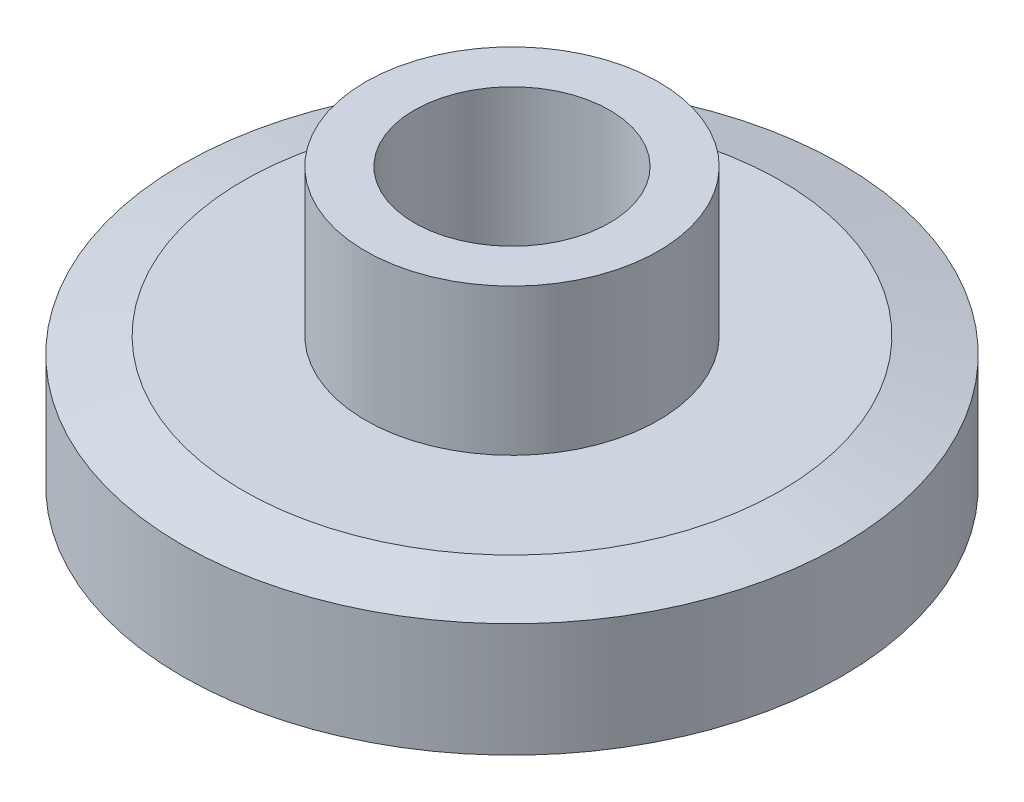
ISO-10303-21;
HEADER;
FILE_DESCRIPTION(('STEP AP214'),'2;1');
FILE_NAME('part.step','',(''),(''),'','','');
FILE_SCHEMA(('AUTOMOTIVE_DESIGN { 1 0 10303 214 1 1 1 1 }'));
ENDSEC;
DATA;
#1=APPLICATION_CONTEXT('core data for automotive mechanical design processes');
#2=APPLICATION_PROTOCOL_DEFINITION('international standard','automotive_design',2000,#1);
#3=PRODUCT_CONTEXT('',#1,'mechanical');
#4=PRODUCT('Part','Part','',(#3));
#5=PRODUCT_RELATED_PRODUCT_CATEGORY('part','',(#4));
#6=PRODUCT_DEFINITION_FORMATION('','',#4);
#7=PRODUCT_DEFINITION_CONTEXT('part definition',#1,'design');
#8=PRODUCT_DEFINITION('design','',#6,#7);
#9=PRODUCT_DEFINITION_SHAPE('','',#8);
#10=(LENGTH_UNIT() NAMED_UNIT(*) SI_UNIT(.MILLI.,.METRE.));
#11=(NAMED_UNIT(*) PLANE_ANGLE_UNIT() SI_UNIT($,.RADIAN.));
#12=(NAMED_UNIT(*) SI_UNIT($,.STERADIAN.) SOLID_ANGLE_UNIT());
#13=UNCERTAINTY_MEASURE_WITH_UNIT(LENGTH_MEASURE(1.E-05),#10,'distance_accuracy_value','');
#14=(GEOMETRIC_REPRESENTATION_CONTEXT(3) GLOBAL_UNCERTAINTY_ASSIGNED_CONTEXT((#13)) GLOBAL_UNIT_ASSIGNED_CONTEXT((#10,
#11,#12)) REPRESENTATION_CONTEXT('',''));
#15=CARTESIAN_POINT('',(0.,0.,0.));
#16=DIRECTION('',(0.,0.,1.));
#17=DIRECTION('',(1.,0.,0.));
#18=AXIS2_PLACEMENT_3D('',#15,#16,#17);
#19=CARTESIAN_POINT('',(0.,0.,0.));
#20=DIRECTION('',(0.,1.,0.));
#21=DIRECTION('',(-1.,0.,0.));
#22=AXIS2_PLACEMENT_3D('',#19,#20,#21);
#23=PLANE('',#22);
#24=CARTESIAN_POINT('',(0.,0.,0.));
#25=DIRECTION('',(0.,1.,0.));
#26=DIRECTION('',(-1.,0.,0.));
#27=AXIS2_PLACEMENT_3D('',#24,#25,#26);
#28=CIRCLE('',#27,2.);
#29=CARTESIAN_POINT('',(-2.,0.,0.));
#30=VERTEX_POINT('',#29);
#31=EDGE_CURVE('E72',#30,#30,#28,.T.);
#32=ORIENTED_EDGE('',*,*,#31,.T.);
#33=EDGE_LOOP('',(#32));
#34=FACE_BOUND('',#33,.T.);
#35=CARTESIAN_POINT('',(0.,0.,0.));
#36=DIRECTION('',(0.,1.,0.));
#37=DIRECTION('',(-1.,0.,0.));
#38=AXIS2_PLACEMENT_3D('',#35,#36,#37);
#39=CIRCLE('',#38,5.49999999999999);
#40=CARTESIAN_POINT('',(-5.49999999999999,0.,0.));
#41=VERTEX_POINT('',#40);
#42=EDGE_CURVE('E10',#41,#41,#39,.F.);
#43=ORIENTED_EDGE('',*,*,#42,.T.);
#44=EDGE_LOOP('',(#43));
#45=FACE_BOUND('',#44,.T.);
#46=ADVANCED_FACE('F39',(#34,#45),#23,.F.);
#47=CARTESIAN_POINT('',(0.,6.,0.));
#48=DIRECTION('',(0.,1.,0.));
#49=DIRECTION('',(-1.,0.,0.));
#50=AXIS2_PLACEMENT_3D('',#47,#48,#49);
#51=CYLINDRICAL_SURFACE('',#50,6.75);
#52=CARTESIAN_POINT('',(0.,0.3349364905389,0.));
#53=DIRECTION('',(0.,1.,0.));
#54=DIRECTION('',(-1.,0.,0.));
#55=AXIS2_PLACEMENT_3D('',#52,#53,#54);
#56=CIRCLE('',#55,6.75);
#57=CARTESIAN_POINT('',(-6.75,0.334936490538898,0.));
#58=VERTEX_POINT('',#57);
#59=EDGE_CURVE('E48',#58,#58,#56,.T.);
#60=ORIENTED_EDGE('',*,*,#59,.T.);
#61=EDGE_LOOP('',(#60));
#62=FACE_BOUND('',#61,.T.);
#63=CARTESIAN_POINT('',(0.,2.6650635094611,0.));
#64=DIRECTION('',(0.,-1.,0.));
#65=DIRECTION('',(1.,0.,0.));
#66=AXIS2_PLACEMENT_3D('',#63,#64,#65);
#67=CIRCLE('',#66,6.75);
#68=CARTESIAN_POINT('',(6.75,2.6650635094611,0.));
#69=VERTEX_POINT('',#68);
#70=EDGE_CURVE('E53',#69,#69,#67,.T.);
#71=ORIENTED_EDGE('',*,*,#70,.T.);
#72=EDGE_LOOP('',(#71));
#73=FACE_BOUND('',#72,.T.);
#74=ADVANCED_FACE('F103',(#62,#73),#51,.T.);
#75=CARTESIAN_POINT('',(6.75,3.,0.));
#76=DIRECTION('',(0.,-1.,0.));
#77=DIRECTION('',(1.,0.,0.));
#78=AXIS2_PLACEMENT_3D('',#75,#76,#77);
#79=PLANE('',#78);
#80=CARTESIAN_POINT('',(0.,3.,0.));
#81=DIRECTION('',(0.,-1.,0.));
#82=DIRECTION('',(1.,0.,0.));
#83=AXIS2_PLACEMENT_3D('',#80,#81,#82);
#84=CIRCLE('',#83,5.49999999999999);
#85=CARTESIAN_POINT('',(5.49999999999998,3.,0.));
#86=VERTEX_POINT('',#85);
#87=EDGE_CURVE('E58',#86,#86,#84,.F.);
#88=ORIENTED_EDGE('',*,*,#87,.T.);
#89=EDGE_LOOP('',(#88));
#90=FACE_BOUND('',#89,.T.);
#91=CARTESIAN_POINT('',(0.,3.,0.));
#92=DIRECTION('',(0.,1.,0.));
#93=DIRECTION('',(-1.,0.,0.));
#94=AXIS2_PLACEMENT_3D('',#91,#92,#93);
#95=CIRCLE('',#94,3.);
#96=CARTESIAN_POINT('',(-3.,3.,0.));
#97=VERTEX_POINT('',#96);
#98=EDGE_CURVE('E64',#97,#97,#95,.T.);
#99=ORIENTED_EDGE('',*,*,#98,.F.);
#100=EDGE_LOOP('',(#99));
#101=FACE_BOUND('',#100,.T.);
#102=ADVANCED_FACE('F98',(#90,#101),#79,.F.);
#103=CARTESIAN_POINT('',(0.,6.,0.));
#104=DIRECTION('',(0.,1.,0.));
#105=DIRECTION('',(-1.,0.,0.));
#106=AXIS2_PLACEMENT_3D('',#103,#104,#105);
#107=CYLINDRICAL_SURFACE('',#106,3.);
#108=CARTESIAN_POINT('',(0.,6.,0.));
#109=DIRECTION('',(0.,1.,0.));
#110=DIRECTION('',(-1.,0.,0.));
#111=AXIS2_PLACEMENT_3D('',#108,#109,#110);
#112=CIRCLE('',#111,3.);
#113=CARTESIAN_POINT('',(-3.,6.,0.));
#114=VERTEX_POINT('',#113);
#115=EDGE_CURVE('E68',#114,#114,#112,.T.);
#116=ORIENTED_EDGE('',*,*,#115,.F.);
#117=EDGE_LOOP('',(#116));
#118=FACE_BOUND('',#117,.T.);
#119=ORIENTED_EDGE('',*,*,#98,.T.);
#120=EDGE_LOOP('',(#119));
#121=FACE_BOUND('',#120,.T.);
#122=ADVANCED_FACE('F92',(#118,#121),#107,.T.);
#123=CARTESIAN_POINT('',(3.,6.,0.));
#124=DIRECTION('',(0.,-1.,0.));
#125=DIRECTION('',(1.,0.,0.));
#126=AXIS2_PLACEMENT_3D('',#123,#124,#125);
#127=PLANE('',#126);
#128=CARTESIAN_POINT('',(0.,6.,0.));
#129=DIRECTION('',(0.,1.,0.));
#130=DIRECTION('',(-1.,0.,0.));
#131=AXIS2_PLACEMENT_3D('',#128,#129,#130);
#132=CIRCLE('',#131,2.);
#133=CARTESIAN_POINT('',(-2.,6.,0.));
#134=VERTEX_POINT('',#133);
#135=EDGE_CURVE('E73',#134,#134,#132,.T.);
#136=ORIENTED_EDGE('',*,*,#135,.F.);
#137=EDGE_LOOP('',(#136));
#138=FACE_BOUND('',#137,.T.);
#139=ORIENTED_EDGE('',*,*,#115,.T.);
#140=EDGE_LOOP('',(#139));
#141=FACE_BOUND('',#140,.T.);
#142=ADVANCED_FACE('F88',(#138,#141),#127,.F.);
#143=CARTESIAN_POINT('',(0.,3.,0.));
#144=DIRECTION('',(0.,-1.,0.));
#145=DIRECTION('',(1.,0.,0.));
#146=AXIS2_PLACEMENT_3D('',#143,#144,#145);
#147=CONICAL_SURFACE('',#146,5.49999999999999,1.30899693899575);
#148=ORIENTED_EDGE('',*,*,#70,.F.);
#149=EDGE_LOOP('',(#148));
#150=FACE_BOUND('',#149,.T.);
#151=ORIENTED_EDGE('',*,*,#87,.F.);
#152=EDGE_LOOP('',(#151));
#153=FACE_BOUND('',#152,.T.);
#154=ADVANCED_FACE('F91',(#150,#153),#147,.T.);
#155=CARTESIAN_POINT('',(0.,0.3349364905389,0.));
#156=DIRECTION('',(0.,1.,0.));
#157=DIRECTION('',(-1.,0.,0.));
#158=AXIS2_PLACEMENT_3D('',#155,#156,#157);
#159=CONICAL_SURFACE('',#158,6.75,1.30899693899575);
#160=ORIENTED_EDGE('',*,*,#42,.F.);
#161=EDGE_LOOP('',(#160));
#162=FACE_BOUND('',#161,.T.);
#163=ORIENTED_EDGE('',*,*,#59,.F.);
#164=EDGE_LOOP('',(#163));
#165=FACE_BOUND('',#164,.T.);
#166=ADVANCED_FACE('F42',(#162,#165),#159,.T.);
#167=CARTESIAN_POINT('',(0.,0.,0.));
#168=DIRECTION('',(0.,1.,0.));
#169=DIRECTION('',(-1.,0.,0.));
#170=AXIS2_PLACEMENT_3D('',#167,#168,#169);
#171=CYLINDRICAL_SURFACE('',#170,2.);
#172=ORIENTED_EDGE('',*,*,#31,.F.);
#173=EDGE_LOOP('',(#172));
#174=FACE_BOUND('',#173,.T.);
#175=ORIENTED_EDGE('',*,*,#135,.T.);
#176=EDGE_LOOP('',(#175));
#177=FACE_BOUND('',#176,.T.);
#178=ADVANCED_FACE('F82',(#174,#177),#171,.F.);
#179=CLOSED_SHELL('',(#46,#74,#102,#122,#142,#154,#166,#178));
#180=MANIFOLD_SOLID_BREP('B2',#179);
#181=ADVANCED_BREP_SHAPE_REPRESENTATION('',(#18,#180),#14);
#182=SHAPE_DEFINITION_REPRESENTATION(#9,#181);
ENDSEC;
END-ISO-10303-21;
